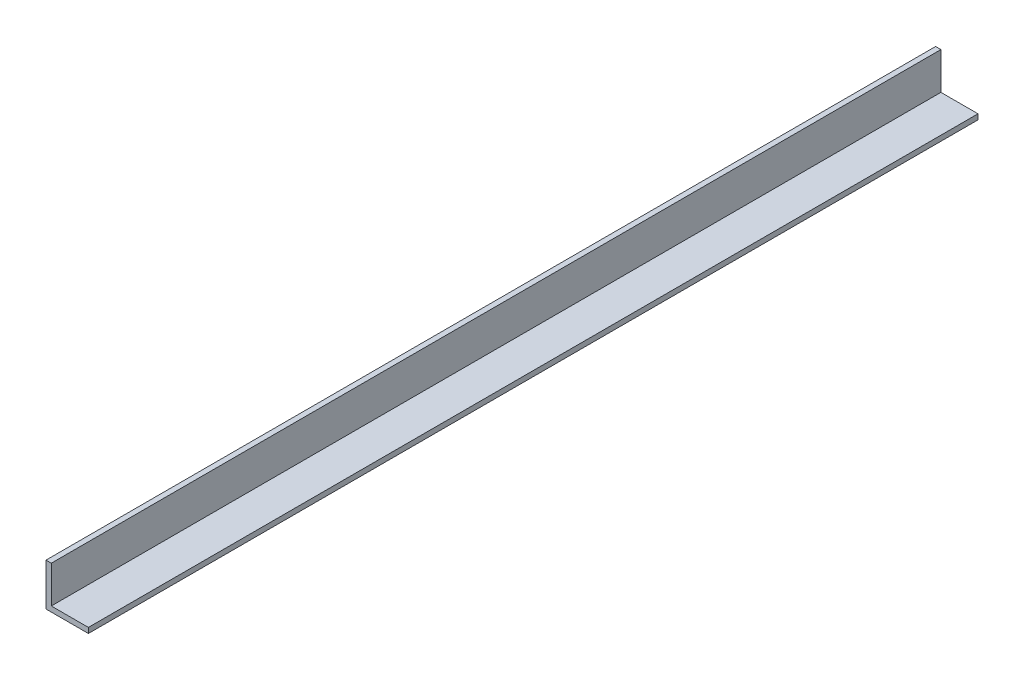
ISO-10303-21;
HEADER;
FILE_DESCRIPTION(('STEP AP214'),'2;1');
FILE_NAME('part.step','',(''),(''),'','','');
FILE_SCHEMA(('AUTOMOTIVE_DESIGN { 1 0 10303 214 1 1 1 1 }'));
ENDSEC;
DATA;
#1=APPLICATION_CONTEXT('core data for automotive mechanical design processes');
#2=APPLICATION_PROTOCOL_DEFINITION('international standard','automotive_design',2000,#1);
#3=PRODUCT_CONTEXT('',#1,'mechanical');
#4=PRODUCT('Part','Part','',(#3));
#5=PRODUCT_RELATED_PRODUCT_CATEGORY('part','',(#4));
#6=PRODUCT_DEFINITION_FORMATION('','',#4);
#7=PRODUCT_DEFINITION_CONTEXT('part definition',#1,'design');
#8=PRODUCT_DEFINITION('design','',#6,#7);
#9=PRODUCT_DEFINITION_SHAPE('','',#8);
#10=(LENGTH_UNIT() NAMED_UNIT(*) SI_UNIT(.MILLI.,.METRE.));
#11=(NAMED_UNIT(*) PLANE_ANGLE_UNIT() SI_UNIT($,.RADIAN.));
#12=(NAMED_UNIT(*) SI_UNIT($,.STERADIAN.) SOLID_ANGLE_UNIT());
#13=UNCERTAINTY_MEASURE_WITH_UNIT(LENGTH_MEASURE(1.E-05),#10,'distance_accuracy_value','');
#14=(GEOMETRIC_REPRESENTATION_CONTEXT(3) GLOBAL_UNCERTAINTY_ASSIGNED_CONTEXT((#13)) GLOBAL_UNIT_ASSIGNED_CONTEXT((#10,
#11,#12)) REPRESENTATION_CONTEXT('',''));
#15=CARTESIAN_POINT('',(0.,0.,0.));
#16=DIRECTION('',(0.,0.,1.));
#17=DIRECTION('',(1.,0.,0.));
#18=AXIS2_PLACEMENT_3D('',#15,#16,#17);
#19=CARTESIAN_POINT('',(3.175,3.175,1219.2));
#20=DIRECTION('',(-1.,0.,0.));
#21=DIRECTION('',(0.,-1.,0.));
#22=AXIS2_PLACEMENT_3D('',#19,#20,#21);
#23=PLANE('',#22);
#24=DIRECTION('',(0.,0.,-1.));
#25=VECTOR('',#24,1.);
#26=CARTESIAN_POINT('',(3.175,25.4,1219.2));
#27=LINE('',#26,#25);
#28=CARTESIAN_POINT('',(3.175,25.4,1219.2));
#29=VERTEX_POINT('',#28);
#30=CARTESIAN_POINT('',(3.17500000000002,25.4,686.));
#31=VERTEX_POINT('',#30);
#32=EDGE_CURVE('E11',#29,#31,#27,.T.);
#33=ORIENTED_EDGE('',*,*,#32,.F.);
#34=DIRECTION('',(0.,1.,0.));
#35=VECTOR('',#34,1.);
#36=CARTESIAN_POINT('',(3.175,3.175,1219.2));
#37=LINE('',#36,#35);
#38=CARTESIAN_POINT('',(3.175,3.175,1219.2));
#39=VERTEX_POINT('',#38);
#40=EDGE_CURVE('E101',#39,#29,#37,.T.);
#41=ORIENTED_EDGE('',*,*,#40,.F.);
#42=DIRECTION('',(0.,0.,-1.));
#43=VECTOR('',#42,1.);
#44=CARTESIAN_POINT('',(3.175,3.175,1286.));
#45=LINE('',#44,#43);
#46=CARTESIAN_POINT('',(3.175,3.175,686.));
#47=VERTEX_POINT('',#46);
#48=EDGE_CURVE('E109',#39,#47,#45,.T.);
#49=ORIENTED_EDGE('',*,*,#48,.T.);
#50=DIRECTION('',(0.,1.,0.));
#51=VECTOR('',#50,1.);
#52=CARTESIAN_POINT('',(3.175,3.175,686.));
#53=LINE('',#52,#51);
#54=EDGE_CURVE('E91',#47,#31,#53,.T.);
#55=ORIENTED_EDGE('',*,*,#54,.T.);
#56=EDGE_LOOP('',(#33,#41,#49,#55));
#57=FACE_BOUND('',#56,.T.);
#58=ADVANCED_FACE('F41',(#57),#23,.F.);
#59=CARTESIAN_POINT('',(3.175,25.4,1219.2));
#60=DIRECTION('',(0.,-1.,0.));
#61=DIRECTION('',(1.,0.,0.));
#62=AXIS2_PLACEMENT_3D('',#59,#60,#61);
#63=PLANE('',#62);
#64=ORIENTED_EDGE('',*,*,#32,.T.);
#65=DIRECTION('',(-1.,0.,0.));
#66=VECTOR('',#65,1.);
#67=CARTESIAN_POINT('',(60.,25.4,686.));
#68=LINE('',#67,#66);
#69=CARTESIAN_POINT('',(0.,25.4,686.));
#70=VERTEX_POINT('',#69);
#71=EDGE_CURVE('E97',#31,#70,#68,.T.);
#72=ORIENTED_EDGE('',*,*,#71,.T.);
#73=DIRECTION('',(0.,0.,-1.));
#74=VECTOR('',#73,1.);
#75=CARTESIAN_POINT('',(0.,25.4,1219.2));
#76=LINE('',#75,#74);
#77=CARTESIAN_POINT('',(0.,25.4,1219.2));
#78=VERTEX_POINT('',#77);
#79=EDGE_CURVE('E48',#78,#70,#76,.T.);
#80=ORIENTED_EDGE('',*,*,#79,.F.);
#81=DIRECTION('',(-1.,0.,0.));
#82=VECTOR('',#81,1.);
#83=CARTESIAN_POINT('',(3.175,25.4,1219.2));
#84=LINE('',#83,#82);
#85=EDGE_CURVE('E123',#29,#78,#84,.T.);
#86=ORIENTED_EDGE('',*,*,#85,.F.);
#87=EDGE_LOOP('',(#64,#72,#80,#86));
#88=FACE_BOUND('',#87,.T.);
#89=ADVANCED_FACE('F146',(#88),#63,.F.);
#90=CARTESIAN_POINT('',(0.,25.4,1219.2));
#91=DIRECTION('',(1.,0.,0.));
#92=DIRECTION('',(0.,1.,0.));
#93=AXIS2_PLACEMENT_3D('',#90,#91,#92);
#94=PLANE('',#93);
#95=ORIENTED_EDGE('',*,*,#79,.T.);
#96=DIRECTION('',(0.,1.,0.));
#97=VECTOR('',#96,1.);
#98=CARTESIAN_POINT('',(0.,25.4,686.));
#99=LINE('',#98,#97);
#100=CARTESIAN_POINT('',(0.,0.,686.));
#101=VERTEX_POINT('',#100);
#102=EDGE_CURVE('E114',#101,#70,#99,.T.);
#103=ORIENTED_EDGE('',*,*,#102,.F.);
#104=DIRECTION('',(0.,0.,-1.));
#105=VECTOR('',#104,1.);
#106=CARTESIAN_POINT('',(0.,0.,1219.2));
#107=LINE('',#106,#105);
#108=CARTESIAN_POINT('',(0.,0.,1219.2));
#109=VERTEX_POINT('',#108);
#110=EDGE_CURVE('E135',#109,#101,#107,.T.);
#111=ORIENTED_EDGE('',*,*,#110,.F.);
#112=DIRECTION('',(0.,-1.,0.));
#113=VECTOR('',#112,1.);
#114=CARTESIAN_POINT('',(0.,25.4,1219.2));
#115=LINE('',#114,#113);
#116=EDGE_CURVE('E125',#78,#109,#115,.T.);
#117=ORIENTED_EDGE('',*,*,#116,.F.);
#118=EDGE_LOOP('',(#95,#103,#111,#117));
#119=FACE_BOUND('',#118,.T.);
#120=ADVANCED_FACE('F142',(#119),#94,.F.);
#121=CARTESIAN_POINT('',(0.,0.,1219.2));
#122=DIRECTION('',(0.,1.,0.));
#123=DIRECTION('',(0.,0.,1.));
#124=AXIS2_PLACEMENT_3D('',#121,#122,#123);
#125=PLANE('',#124);
#126=ORIENTED_EDGE('',*,*,#110,.T.);
#127=DIRECTION('',(1.,0.,0.));
#128=VECTOR('',#127,1.);
#129=CARTESIAN_POINT('',(0.,0.,686.));
#130=LINE('',#129,#128);
#131=CARTESIAN_POINT('',(25.4,0.,686.));
#132=VERTEX_POINT('',#131);
#133=EDGE_CURVE('E102',#101,#132,#130,.T.);
#134=ORIENTED_EDGE('',*,*,#133,.T.);
#135=DIRECTION('',(0.,0.,-1.));
#136=VECTOR('',#135,1.);
#137=CARTESIAN_POINT('',(25.4,0.,1219.2));
#138=LINE('',#137,#136);
#139=CARTESIAN_POINT('',(25.4,0.,1219.2));
#140=VERTEX_POINT('',#139);
#141=EDGE_CURVE('E132',#140,#132,#138,.T.);
#142=ORIENTED_EDGE('',*,*,#141,.F.);
#143=DIRECTION('',(1.,0.,0.));
#144=VECTOR('',#143,1.);
#145=CARTESIAN_POINT('',(0.,0.,1219.2));
#146=LINE('',#145,#144);
#147=EDGE_CURVE('E60',#109,#140,#146,.T.);
#148=ORIENTED_EDGE('',*,*,#147,.F.);
#149=EDGE_LOOP('',(#126,#134,#142,#148));
#150=FACE_BOUND('',#149,.T.);
#151=ADVANCED_FACE('F149',(#150),#125,.F.);
#152=CARTESIAN_POINT('',(25.4,0.,1219.2));
#153=DIRECTION('',(-1.,0.,0.));
#154=DIRECTION('',(0.,0.,1.));
#155=AXIS2_PLACEMENT_3D('',#152,#153,#154);
#156=PLANE('',#155);
#157=ORIENTED_EDGE('',*,*,#141,.T.);
#158=DIRECTION('',(0.,1.,0.));
#159=VECTOR('',#158,1.);
#160=CARTESIAN_POINT('',(25.4,0.,686.));
#161=LINE('',#160,#159);
#162=CARTESIAN_POINT('',(25.4,3.175,686.));
#163=VERTEX_POINT('',#162);
#164=EDGE_CURVE('E111',#132,#163,#161,.T.);
#165=ORIENTED_EDGE('',*,*,#164,.T.);
#166=DIRECTION('',(0.,0.,-1.));
#167=VECTOR('',#166,1.);
#168=CARTESIAN_POINT('',(25.4,3.175,1219.2));
#169=LINE('',#168,#167);
#170=CARTESIAN_POINT('',(25.4,3.175,1219.2));
#171=VERTEX_POINT('',#170);
#172=EDGE_CURVE('E110',#171,#163,#169,.T.);
#173=ORIENTED_EDGE('',*,*,#172,.F.);
#174=DIRECTION('',(0.,1.,0.));
#175=VECTOR('',#174,1.);
#176=CARTESIAN_POINT('',(25.4,0.,1219.2));
#177=LINE('',#176,#175);
#178=EDGE_CURVE('E55',#140,#171,#177,.T.);
#179=ORIENTED_EDGE('',*,*,#178,.F.);
#180=EDGE_LOOP('',(#157,#165,#173,#179));
#181=FACE_BOUND('',#180,.T.);
#182=ADVANCED_FACE('F151',(#181),#156,.F.);
#183=CARTESIAN_POINT('',(25.4,3.175,1219.2));
#184=DIRECTION('',(0.,-1.,0.));
#185=DIRECTION('',(1.,0.,0.));
#186=AXIS2_PLACEMENT_3D('',#183,#184,#185);
#187=PLANE('',#186);
#188=DIRECTION('',(-1.,0.,0.));
#189=VECTOR('',#188,1.);
#190=CARTESIAN_POINT('',(25.4,3.175,686.));
#191=LINE('',#190,#189);
#192=EDGE_CURVE('E94',#163,#47,#191,.T.);
#193=ORIENTED_EDGE('',*,*,#192,.T.);
#194=ORIENTED_EDGE('',*,*,#48,.F.);
#195=DIRECTION('',(-1.,0.,0.));
#196=VECTOR('',#195,1.);
#197=CARTESIAN_POINT('',(25.4,3.175,1219.2));
#198=LINE('',#197,#196);
#199=EDGE_CURVE('E129',#171,#39,#198,.T.);
#200=ORIENTED_EDGE('',*,*,#199,.F.);
#201=ORIENTED_EDGE('',*,*,#172,.T.);
#202=EDGE_LOOP('',(#193,#194,#200,#201));
#203=FACE_BOUND('',#202,.T.);
#204=ADVANCED_FACE('F107',(#203),#187,.F.);
#205=CARTESIAN_POINT('',(0.,0.,1219.2));
#206=DIRECTION('',(0.,0.,1.));
#207=DIRECTION('',(1.,0.,0.));
#208=AXIS2_PLACEMENT_3D('',#205,#206,#207);
#209=PLANE('',#208);
#210=ORIENTED_EDGE('',*,*,#199,.T.);
#211=ORIENTED_EDGE('',*,*,#40,.T.);
#212=ORIENTED_EDGE('',*,*,#85,.T.);
#213=ORIENTED_EDGE('',*,*,#116,.T.);
#214=ORIENTED_EDGE('',*,*,#147,.T.);
#215=ORIENTED_EDGE('',*,*,#178,.T.);
#216=EDGE_LOOP('',(#210,#211,#212,#213,#214,#215));
#217=FACE_BOUND('',#216,.T.);
#218=ADVANCED_FACE('F147',(#217),#209,.T.);
#219=CARTESIAN_POINT('',(60.,25.4,686.));
#220=DIRECTION('',(0.,0.,1.));
#221=DIRECTION('',(1.,0.,0.));
#222=AXIS2_PLACEMENT_3D('',#219,#220,#221);
#223=PLANE('',#222);
#224=ORIENTED_EDGE('',*,*,#54,.F.);
#225=ORIENTED_EDGE('',*,*,#192,.F.);
#226=ORIENTED_EDGE('',*,*,#164,.F.);
#227=ORIENTED_EDGE('',*,*,#133,.F.);
#228=ORIENTED_EDGE('',*,*,#102,.T.);
#229=ORIENTED_EDGE('',*,*,#71,.F.);
#230=EDGE_LOOP('',(#224,#225,#226,#227,#228,#229));
#231=FACE_BOUND('',#230,.T.);
#232=ADVANCED_FACE('F93',(#231),#223,.F.);
#233=CLOSED_SHELL('',(#58,#89,#120,#151,#182,#204,#218,#232));
#234=MANIFOLD_SOLID_BREP('B2',#233);
#235=ADVANCED_BREP_SHAPE_REPRESENTATION('',(#18,#234),#14);
#236=SHAPE_DEFINITION_REPRESENTATION(#9,#235);
ENDSEC;
END-ISO-10303-21;
